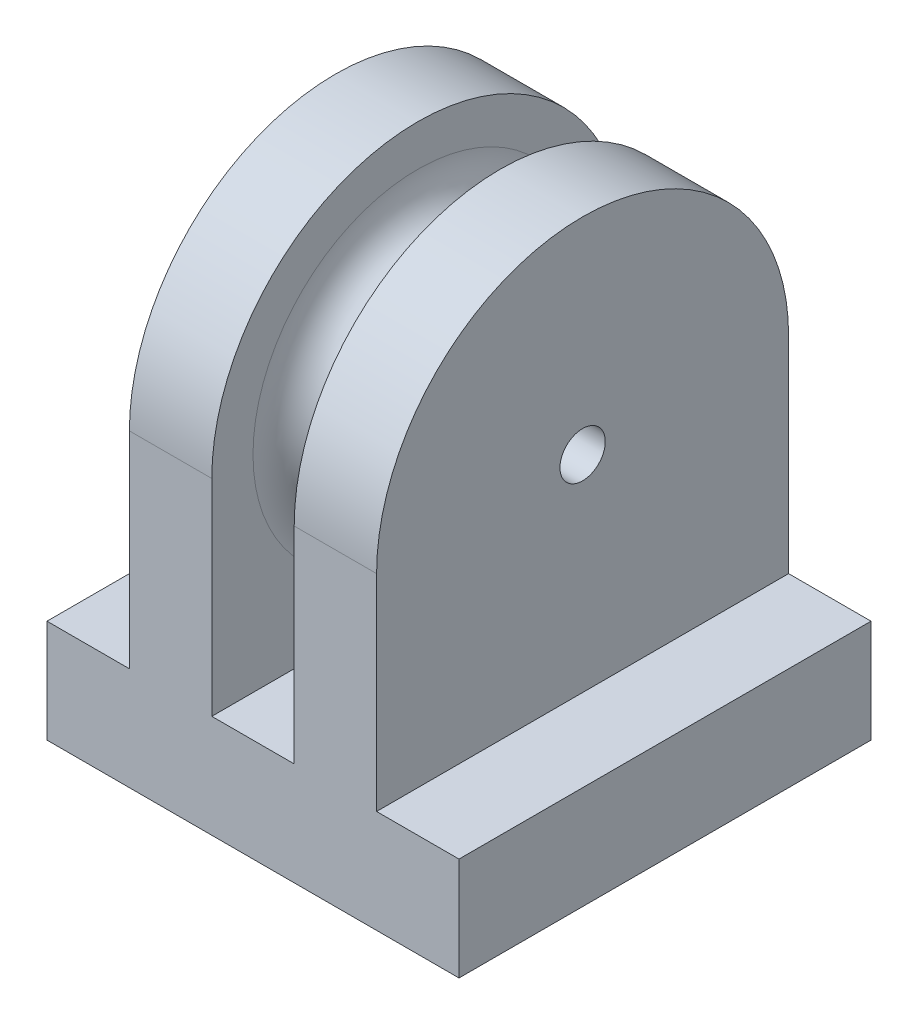
ISO-10303-21;
HEADER;
FILE_DESCRIPTION(('STEP AP214'),'2;1');
FILE_NAME('part.step','',(''),(''),'','','');
FILE_SCHEMA(('AUTOMOTIVE_DESIGN { 1 0 10303 214 1 1 1 1 }'));
ENDSEC;
DATA;
#1=APPLICATION_CONTEXT('core data for automotive mechanical design processes');
#2=APPLICATION_PROTOCOL_DEFINITION('international standard','automotive_design',2000,#1);
#3=PRODUCT_CONTEXT('',#1,'mechanical');
#4=PRODUCT('Part','Part','',(#3));
#5=PRODUCT_RELATED_PRODUCT_CATEGORY('part','',(#4));
#6=PRODUCT_DEFINITION_FORMATION('','',#4);
#7=PRODUCT_DEFINITION_CONTEXT('part definition',#1,'design');
#8=PRODUCT_DEFINITION('design','',#6,#7);
#9=PRODUCT_DEFINITION_SHAPE('','',#8);
#10=(LENGTH_UNIT() NAMED_UNIT(*) SI_UNIT(.MILLI.,.METRE.));
#11=(NAMED_UNIT(*) PLANE_ANGLE_UNIT() SI_UNIT($,.RADIAN.));
#12=(NAMED_UNIT(*) SI_UNIT($,.STERADIAN.) SOLID_ANGLE_UNIT());
#13=UNCERTAINTY_MEASURE_WITH_UNIT(LENGTH_MEASURE(1.E-05),#10,'distance_accuracy_value','');
#14=(GEOMETRIC_REPRESENTATION_CONTEXT(3) GLOBAL_UNCERTAINTY_ASSIGNED_CONTEXT((#13)) GLOBAL_UNIT_ASSIGNED_CONTEXT((#10,
#11,#12)) REPRESENTATION_CONTEXT('',''));
#15=CARTESIAN_POINT('',(0.,0.,0.));
#16=DIRECTION('',(0.,0.,1.));
#17=DIRECTION('',(1.,0.,0.));
#18=AXIS2_PLACEMENT_3D('',#15,#16,#17);
#19=CARTESIAN_POINT('',(0.,5.,0.));
#20=DIRECTION('',(0.,-1.,0.));
#21=DIRECTION('',(0.,0.,-1.));
#22=AXIS2_PLACEMENT_3D('',#19,#20,#21);
#23=PLANE('',#22);
#24=CARTESIAN_POINT('',(10.,5.,-4.));
#25=DIRECTION('',(0.,1.,0.));
#26=DIRECTION('',(0.,0.,1.));
#27=AXIS2_PLACEMENT_3D('',#24,#25,#26);
#28=CIRCLE('',#27,0.500000000000001);
#29=CARTESIAN_POINT('',(10.,5.,-3.5));
#30=VERTEX_POINT('',#29);
#31=EDGE_CURVE('E291',#30,#30,#28,.T.);
#32=ORIENTED_EDGE('',*,*,#31,.F.);
#33=EDGE_LOOP('',(#32));
#34=FACE_BOUND('',#33,.T.);
#35=CARTESIAN_POINT('',(10.,5.,-16.));
#36=DIRECTION('',(0.,1.,0.));
#37=DIRECTION('',(0.,0.,-1.));
#38=AXIS2_PLACEMENT_3D('',#35,#36,#37);
#39=CIRCLE('',#38,0.500000000000001);
#40=CARTESIAN_POINT('',(10.,5.,-16.5));
#41=VERTEX_POINT('',#40);
#42=EDGE_CURVE('E282',#41,#41,#39,.T.);
#43=ORIENTED_EDGE('',*,*,#42,.F.);
#44=EDGE_LOOP('',(#43));
#45=FACE_BOUND('',#44,.T.);
#46=DIRECTION('',(0.,0.,1.));
#47=VECTOR('',#46,1.);
#48=CARTESIAN_POINT('',(12.,5.,-20.));
#49=LINE('',#48,#47);
#50=CARTESIAN_POINT('',(12.,5.,-20.));
#51=VERTEX_POINT('',#50);
#52=CARTESIAN_POINT('',(12.,5.,0.));
#53=VERTEX_POINT('',#52);
#54=EDGE_CURVE('E66',#51,#53,#49,.T.);
#55=ORIENTED_EDGE('',*,*,#54,.F.);
#56=DIRECTION('',(-1.,0.,0.));
#57=VECTOR('',#56,1.);
#58=CARTESIAN_POINT('',(0.,5.,-20.));
#59=LINE('',#58,#57);
#60=CARTESIAN_POINT('',(8.,5.,-20.));
#61=VERTEX_POINT('',#60);
#62=EDGE_CURVE('E241',#51,#61,#59,.T.);
#63=ORIENTED_EDGE('',*,*,#62,.T.);
#64=DIRECTION('',(0.,0.,-1.));
#65=VECTOR('',#64,1.);
#66=CARTESIAN_POINT('',(8.,5.,-20.));
#67=LINE('',#66,#65);
#68=CARTESIAN_POINT('',(8.,5.,0.));
#69=VERTEX_POINT('',#68);
#70=EDGE_CURVE('E197',#69,#61,#67,.T.);
#71=ORIENTED_EDGE('',*,*,#70,.F.);
#72=DIRECTION('',(1.,0.,0.));
#73=VECTOR('',#72,1.);
#74=CARTESIAN_POINT('',(0.,5.,0.));
#75=LINE('',#74,#73);
#76=EDGE_CURVE('E233',#69,#53,#75,.T.);
#77=ORIENTED_EDGE('',*,*,#76,.T.);
#78=EDGE_LOOP('',(#55,#63,#71,#77));
#79=FACE_BOUND('',#78,.T.);
#80=ADVANCED_FACE('F41',(#34,#45,#79),#23,.F.);
#81=DIRECTION('',(0.,0.,-1.));
#82=VECTOR('',#81,1.);
#83=CARTESIAN_POINT('',(16.,5.,-20.));
#84=LINE('',#83,#82);
#85=CARTESIAN_POINT('',(16.,5.,0.));
#86=VERTEX_POINT('',#85);
#87=CARTESIAN_POINT('',(16.,5.,-20.));
#88=VERTEX_POINT('',#87);
#89=EDGE_CURVE('E58',#86,#88,#84,.T.);
#90=ORIENTED_EDGE('',*,*,#89,.F.);
#91=CARTESIAN_POINT('',(20.,5.,0.));
#92=VERTEX_POINT('',#91);
#93=EDGE_CURVE('E226',#86,#92,#75,.T.);
#94=ORIENTED_EDGE('',*,*,#93,.T.);
#95=DIRECTION('',(0.,0.,-1.));
#96=VECTOR('',#95,1.);
#97=CARTESIAN_POINT('',(20.,5.,0.));
#98=LINE('',#97,#96);
#99=CARTESIAN_POINT('',(20.,5.,-20.));
#100=VERTEX_POINT('',#99);
#101=EDGE_CURVE('E232',#92,#100,#98,.T.);
#102=ORIENTED_EDGE('',*,*,#101,.T.);
#103=EDGE_CURVE('E237',#100,#88,#59,.T.);
#104=ORIENTED_EDGE('',*,*,#103,.T.);
#105=EDGE_LOOP('',(#90,#94,#102,#104));
#106=FACE_BOUND('',#105,.T.);
#107=ADVANCED_FACE('F312',(#106),#23,.F.);
#108=DIRECTION('',(0.,0.,1.));
#109=VECTOR('',#108,1.);
#110=CARTESIAN_POINT('',(4.,5.,-20.));
#111=LINE('',#110,#109);
#112=CARTESIAN_POINT('',(4.,5.,-20.));
#113=VERTEX_POINT('',#112);
#114=CARTESIAN_POINT('',(4.,5.,0.));
#115=VERTEX_POINT('',#114);
#116=EDGE_CURVE('E191',#113,#115,#111,.T.);
#117=ORIENTED_EDGE('',*,*,#116,.F.);
#118=CARTESIAN_POINT('',(0.,5.,-20.));
#119=VERTEX_POINT('',#118);
#120=EDGE_CURVE('E236',#113,#119,#59,.T.);
#121=ORIENTED_EDGE('',*,*,#120,.T.);
#122=DIRECTION('',(0.,0.,1.));
#123=VECTOR('',#122,1.);
#124=CARTESIAN_POINT('',(0.,5.,0.));
#125=LINE('',#124,#123);
#126=CARTESIAN_POINT('',(0.,5.,0.));
#127=VERTEX_POINT('',#126);
#128=EDGE_CURVE('E222',#119,#127,#125,.T.);
#129=ORIENTED_EDGE('',*,*,#128,.T.);
#130=EDGE_CURVE('E228',#127,#115,#75,.T.);
#131=ORIENTED_EDGE('',*,*,#130,.T.);
#132=EDGE_LOOP('',(#117,#121,#129,#131));
#133=FACE_BOUND('',#132,.T.);
#134=ADVANCED_FACE('F314',(#133),#23,.F.);
#135=CARTESIAN_POINT('',(0.,5.,0.));
#136=DIRECTION('',(1.,0.,0.));
#137=DIRECTION('',(0.,0.,-1.));
#138=AXIS2_PLACEMENT_3D('',#135,#136,#137);
#139=PLANE('',#138);
#140=DIRECTION('',(0.,0.,1.));
#141=VECTOR('',#140,1.);
#142=CARTESIAN_POINT('',(0.,0.,0.));
#143=LINE('',#142,#141);
#144=CARTESIAN_POINT('',(0.,0.,-20.));
#145=VERTEX_POINT('',#144);
#146=CARTESIAN_POINT('',(0.,0.,0.));
#147=VERTEX_POINT('',#146);
#148=EDGE_CURVE('E221',#145,#147,#143,.T.);
#149=ORIENTED_EDGE('',*,*,#148,.T.);
#150=DIRECTION('',(0.,-1.,0.));
#151=VECTOR('',#150,1.);
#152=CARTESIAN_POINT('',(0.,5.,0.));
#153=LINE('',#152,#151);
#154=EDGE_CURVE('E264',#127,#147,#153,.T.);
#155=ORIENTED_EDGE('',*,*,#154,.F.);
#156=ORIENTED_EDGE('',*,*,#128,.F.);
#157=DIRECTION('',(0.,-1.,0.));
#158=VECTOR('',#157,1.);
#159=CARTESIAN_POINT('',(0.,5.,-20.));
#160=LINE('',#159,#158);
#161=EDGE_CURVE('E240',#119,#145,#160,.T.);
#162=ORIENTED_EDGE('',*,*,#161,.T.);
#163=EDGE_LOOP('',(#149,#155,#156,#162));
#164=FACE_BOUND('',#163,.T.);
#165=ADVANCED_FACE('F335',(#164),#139,.F.);
#166=CARTESIAN_POINT('',(0.,5.,0.));
#167=DIRECTION('',(0.,0.,-1.));
#168=DIRECTION('',(-1.,0.,0.));
#169=AXIS2_PLACEMENT_3D('',#166,#167,#168);
#170=PLANE('',#169);
#171=DIRECTION('',(1.,0.,0.));
#172=VECTOR('',#171,1.);
#173=CARTESIAN_POINT('',(0.,0.,0.));
#174=LINE('',#173,#172);
#175=CARTESIAN_POINT('',(20.,0.,0.));
#176=VERTEX_POINT('',#175);
#177=EDGE_CURVE('E245',#147,#176,#174,.T.);
#178=ORIENTED_EDGE('',*,*,#177,.T.);
#179=DIRECTION('',(0.,-1.,0.));
#180=VECTOR('',#179,1.);
#181=CARTESIAN_POINT('',(20.,5.,0.));
#182=LINE('',#181,#180);
#183=EDGE_CURVE('E260',#92,#176,#182,.T.);
#184=ORIENTED_EDGE('',*,*,#183,.F.);
#185=ORIENTED_EDGE('',*,*,#93,.F.);
#186=DIRECTION('',(0.,-1.,0.));
#187=VECTOR('',#186,1.);
#188=CARTESIAN_POINT('',(16.,15.,0.));
#189=LINE('',#188,#187);
#190=CARTESIAN_POINT('',(16.,15.,0.));
#191=VERTEX_POINT('',#190);
#192=EDGE_CURVE('E153',#191,#86,#189,.T.);
#193=ORIENTED_EDGE('',*,*,#192,.F.);
#194=DIRECTION('',(1.,0.,0.));
#195=VECTOR('',#194,1.);
#196=CARTESIAN_POINT('',(12.,15.,0.));
#197=LINE('',#196,#195);
#198=CARTESIAN_POINT('',(12.,15.,0.));
#199=VERTEX_POINT('',#198);
#200=EDGE_CURVE('E145',#199,#191,#197,.T.);
#201=ORIENTED_EDGE('',*,*,#200,.F.);
#202=DIRECTION('',(0.,-1.,0.));
#203=VECTOR('',#202,1.);
#204=CARTESIAN_POINT('',(12.,15.,0.));
#205=LINE('',#204,#203);
#206=EDGE_CURVE('E187',#199,#53,#205,.T.);
#207=ORIENTED_EDGE('',*,*,#206,.T.);
#208=ORIENTED_EDGE('',*,*,#76,.F.);
#209=DIRECTION('',(0.,-1.,0.));
#210=VECTOR('',#209,1.);
#211=CARTESIAN_POINT('',(8.,15.,0.));
#212=LINE('',#211,#210);
#213=CARTESIAN_POINT('',(8.,15.,0.));
#214=VERTEX_POINT('',#213);
#215=EDGE_CURVE('E213',#214,#69,#212,.T.);
#216=ORIENTED_EDGE('',*,*,#215,.F.);
#217=DIRECTION('',(1.,0.,0.));
#218=VECTOR('',#217,1.);
#219=CARTESIAN_POINT('',(4.,15.,0.));
#220=LINE('',#219,#218);
#221=CARTESIAN_POINT('',(4.,15.,0.));
#222=VERTEX_POINT('',#221);
#223=EDGE_CURVE('E192',#222,#214,#220,.T.);
#224=ORIENTED_EDGE('',*,*,#223,.F.);
#225=DIRECTION('',(0.,-1.,0.));
#226=VECTOR('',#225,1.);
#227=CARTESIAN_POINT('',(4.,15.,0.));
#228=LINE('',#227,#226);
#229=EDGE_CURVE('E217',#222,#115,#228,.T.);
#230=ORIENTED_EDGE('',*,*,#229,.T.);
#231=ORIENTED_EDGE('',*,*,#130,.F.);
#232=ORIENTED_EDGE('',*,*,#154,.T.);
#233=EDGE_LOOP('',(#178,#184,#185,#193,#201,#207,#208,#216,#224,#230,#231,#232));
#234=FACE_BOUND('',#233,.T.);
#235=ADVANCED_FACE('F320',(#234),#170,.F.);
#236=CARTESIAN_POINT('',(20.,5.,0.));
#237=DIRECTION('',(-1.,0.,0.));
#238=DIRECTION('',(0.,0.,1.));
#239=AXIS2_PLACEMENT_3D('',#236,#237,#238);
#240=PLANE('',#239);
#241=DIRECTION('',(0.,0.,-1.));
#242=VECTOR('',#241,1.);
#243=CARTESIAN_POINT('',(20.,0.,0.));
#244=LINE('',#243,#242);
#245=CARTESIAN_POINT('',(20.,0.,-20.));
#246=VERTEX_POINT('',#245);
#247=EDGE_CURVE('E248',#176,#246,#244,.T.);
#248=ORIENTED_EDGE('',*,*,#247,.T.);
#249=DIRECTION('',(0.,-1.,0.));
#250=VECTOR('',#249,1.);
#251=CARTESIAN_POINT('',(20.,5.,-20.));
#252=LINE('',#251,#250);
#253=EDGE_CURVE('E256',#100,#246,#252,.T.);
#254=ORIENTED_EDGE('',*,*,#253,.F.);
#255=ORIENTED_EDGE('',*,*,#101,.F.);
#256=ORIENTED_EDGE('',*,*,#183,.T.);
#257=EDGE_LOOP('',(#248,#254,#255,#256));
#258=FACE_BOUND('',#257,.T.);
#259=ADVANCED_FACE('F363',(#258),#240,.F.);
#260=CARTESIAN_POINT('',(0.,5.,-20.));
#261=DIRECTION('',(0.,0.,1.));
#262=DIRECTION('',(1.,0.,0.));
#263=AXIS2_PLACEMENT_3D('',#260,#261,#262);
#264=PLANE('',#263);
#265=DIRECTION('',(-1.,0.,0.));
#266=VECTOR('',#265,1.);
#267=CARTESIAN_POINT('',(0.,0.,-20.));
#268=LINE('',#267,#266);
#269=EDGE_CURVE('E227',#246,#145,#268,.T.);
#270=ORIENTED_EDGE('',*,*,#269,.T.);
#271=ORIENTED_EDGE('',*,*,#161,.F.);
#272=ORIENTED_EDGE('',*,*,#120,.F.);
#273=DIRECTION('',(0.,-1.,0.));
#274=VECTOR('',#273,1.);
#275=CARTESIAN_POINT('',(4.,15.,-20.));
#276=LINE('',#275,#274);
#277=CARTESIAN_POINT('',(4.,15.,-20.));
#278=VERTEX_POINT('',#277);
#279=EDGE_CURVE('E201',#278,#113,#276,.T.);
#280=ORIENTED_EDGE('',*,*,#279,.F.);
#281=DIRECTION('',(-1.,0.,0.));
#282=VECTOR('',#281,1.);
#283=CARTESIAN_POINT('',(4.,15.,-20.));
#284=LINE('',#283,#282);
#285=CARTESIAN_POINT('',(8.,15.,-20.));
#286=VERTEX_POINT('',#285);
#287=EDGE_CURVE('E196',#286,#278,#284,.T.);
#288=ORIENTED_EDGE('',*,*,#287,.F.);
#289=DIRECTION('',(0.,-1.,0.));
#290=VECTOR('',#289,1.);
#291=CARTESIAN_POINT('',(8.,15.,-20.));
#292=LINE('',#291,#290);
#293=EDGE_CURVE('E209',#286,#61,#292,.T.);
#294=ORIENTED_EDGE('',*,*,#293,.T.);
#295=ORIENTED_EDGE('',*,*,#62,.F.);
#296=DIRECTION('',(0.,-1.,0.));
#297=VECTOR('',#296,1.);
#298=CARTESIAN_POINT('',(12.,15.,-20.));
#299=LINE('',#298,#297);
#300=CARTESIAN_POINT('',(12.,15.,-20.));
#301=VERTEX_POINT('',#300);
#302=EDGE_CURVE('E139',#301,#51,#299,.T.);
#303=ORIENTED_EDGE('',*,*,#302,.F.);
#304=DIRECTION('',(-1.,0.,0.));
#305=VECTOR('',#304,1.);
#306=CARTESIAN_POINT('',(12.,15.,-20.));
#307=LINE('',#306,#305);
#308=CARTESIAN_POINT('',(16.,15.,-20.));
#309=VERTEX_POINT('',#308);
#310=EDGE_CURVE('E134',#309,#301,#307,.T.);
#311=ORIENTED_EDGE('',*,*,#310,.F.);
#312=DIRECTION('',(0.,-1.,0.));
#313=VECTOR('',#312,1.);
#314=CARTESIAN_POINT('',(16.,15.,-20.));
#315=LINE('',#314,#313);
#316=EDGE_CURVE('E138',#309,#88,#315,.T.);
#317=ORIENTED_EDGE('',*,*,#316,.T.);
#318=ORIENTED_EDGE('',*,*,#103,.F.);
#319=ORIENTED_EDGE('',*,*,#253,.T.);
#320=EDGE_LOOP('',(#270,#271,#272,#280,#288,#294,#295,#303,#311,#317,#318,#319));
#321=FACE_BOUND('',#320,.T.);
#322=ADVANCED_FACE('F136',(#321),#264,.F.);
#323=CARTESIAN_POINT('',(0.,0.,0.));
#324=DIRECTION('',(0.,-1.,0.));
#325=DIRECTION('',(0.,0.,-1.));
#326=AXIS2_PLACEMENT_3D('',#323,#324,#325);
#327=PLANE('',#326);
#328=CARTESIAN_POINT('',(10.,0.,-4.));
#329=DIRECTION('',(0.,1.,0.));
#330=DIRECTION('',(0.,0.,1.));
#331=AXIS2_PLACEMENT_3D('',#328,#329,#330);
#332=CIRCLE('',#331,0.500000000000001);
#333=CARTESIAN_POINT('',(10.,0.,-3.5));
#334=VERTEX_POINT('',#333);
#335=EDGE_CURVE('E296',#334,#334,#332,.T.);
#336=ORIENTED_EDGE('',*,*,#335,.T.);
#337=EDGE_LOOP('',(#336));
#338=FACE_BOUND('',#337,.T.);
#339=CARTESIAN_POINT('',(10.,0.,-16.));
#340=DIRECTION('',(0.,1.,0.));
#341=DIRECTION('',(0.,0.,-1.));
#342=AXIS2_PLACEMENT_3D('',#339,#340,#341);
#343=CIRCLE('',#342,0.500000000000001);
#344=CARTESIAN_POINT('',(10.,0.,-16.5));
#345=VERTEX_POINT('',#344);
#346=EDGE_CURVE('E285',#345,#345,#343,.T.);
#347=ORIENTED_EDGE('',*,*,#346,.T.);
#348=EDGE_LOOP('',(#347));
#349=FACE_BOUND('',#348,.T.);
#350=ORIENTED_EDGE('',*,*,#148,.F.);
#351=ORIENTED_EDGE('',*,*,#269,.F.);
#352=ORIENTED_EDGE('',*,*,#247,.F.);
#353=ORIENTED_EDGE('',*,*,#177,.F.);
#354=EDGE_LOOP('',(#350,#351,#352,#353));
#355=FACE_BOUND('',#354,.T.);
#356=ADVANCED_FACE('F353',(#338,#349,#355),#327,.T.);
#357=CARTESIAN_POINT('',(4.,15.,-20.));
#358=DIRECTION('',(1.,0.,0.));
#359=DIRECTION('',(0.,0.,-1.));
#360=AXIS2_PLACEMENT_3D('',#357,#358,#359);
#361=PLANE('',#360);
#362=CARTESIAN_POINT('',(4.,15.,-10.));
#363=DIRECTION('',(-1.,0.,0.));
#364=DIRECTION('',(0.,0.,1.));
#365=AXIS2_PLACEMENT_3D('',#362,#363,#364);
#366=CIRCLE('',#365,1.1);
#367=CARTESIAN_POINT('',(4.,15.,-8.9));
#368=VERTEX_POINT('',#367);
#369=EDGE_CURVE('E166',#368,#368,#366,.T.);
#370=ORIENTED_EDGE('',*,*,#369,.F.);
#371=EDGE_LOOP('',(#370));
#372=FACE_BOUND('',#371,.T.);
#373=ORIENTED_EDGE('',*,*,#116,.T.);
#374=ORIENTED_EDGE('',*,*,#229,.F.);
#375=CARTESIAN_POINT('',(4.,15.,-10.));
#376=DIRECTION('',(-1.,0.,0.));
#377=DIRECTION('',(0.,0.,1.));
#378=AXIS2_PLACEMENT_3D('',#375,#376,#377);
#379=CIRCLE('',#378,10.);
#380=EDGE_CURVE('E163',#222,#278,#379,.T.);
#381=ORIENTED_EDGE('',*,*,#380,.T.);
#382=ORIENTED_EDGE('',*,*,#279,.T.);
#383=EDGE_LOOP('',(#373,#374,#381,#382));
#384=FACE_BOUND('',#383,.T.);
#385=ADVANCED_FACE('F339',(#372,#384),#361,.F.);
#386=CARTESIAN_POINT('',(8.,15.,-20.));
#387=DIRECTION('',(-1.,0.,0.));
#388=DIRECTION('',(0.,0.,1.));
#389=AXIS2_PLACEMENT_3D('',#386,#387,#388);
#390=PLANE('',#389);
#391=CARTESIAN_POINT('',(8.,15.,-10.));
#392=DIRECTION('',(-1.,0.,0.));
#393=DIRECTION('',(0.,0.,1.));
#394=AXIS2_PLACEMENT_3D('',#391,#392,#393);
#395=CIRCLE('',#394,8.);
#396=CARTESIAN_POINT('',(8.,15.,-2.));
#397=VERTEX_POINT('',#396);
#398=EDGE_CURVE('E51',#397,#397,#395,.T.);
#399=ORIENTED_EDGE('',*,*,#398,.T.);
#400=EDGE_LOOP('',(#399));
#401=FACE_BOUND('',#400,.T.);
#402=ORIENTED_EDGE('',*,*,#70,.T.);
#403=ORIENTED_EDGE('',*,*,#293,.F.);
#404=CARTESIAN_POINT('',(8.,15.,-10.));
#405=DIRECTION('',(-1.,0.,0.));
#406=DIRECTION('',(0.,0.,1.));
#407=AXIS2_PLACEMENT_3D('',#404,#405,#406);
#408=CIRCLE('',#407,10.);
#409=EDGE_CURVE('E170',#214,#286,#408,.T.);
#410=ORIENTED_EDGE('',*,*,#409,.F.);
#411=ORIENTED_EDGE('',*,*,#215,.T.);
#412=EDGE_LOOP('',(#402,#403,#410,#411));
#413=FACE_BOUND('',#412,.T.);
#414=ADVANCED_FACE('F272',(#401,#413),#390,.F.);
#415=CARTESIAN_POINT('',(12.,15.,-20.));
#416=DIRECTION('',(1.,0.,0.));
#417=DIRECTION('',(0.,0.,-1.));
#418=AXIS2_PLACEMENT_3D('',#415,#416,#417);
#419=PLANE('',#418);
#420=CARTESIAN_POINT('',(12.,15.,-10.));
#421=DIRECTION('',(1.,0.,0.));
#422=DIRECTION('',(0.,0.,-1.));
#423=AXIS2_PLACEMENT_3D('',#420,#421,#422);
#424=CIRCLE('',#423,8.);
#425=CARTESIAN_POINT('',(12.,15.,-18.));
#426=VERTEX_POINT('',#425);
#427=EDGE_CURVE('E11',#426,#426,#424,.T.);
#428=ORIENTED_EDGE('',*,*,#427,.T.);
#429=EDGE_LOOP('',(#428));
#430=FACE_BOUND('',#429,.T.);
#431=ORIENTED_EDGE('',*,*,#54,.T.);
#432=ORIENTED_EDGE('',*,*,#206,.F.);
#433=CARTESIAN_POINT('',(12.,15.,-10.));
#434=DIRECTION('',(1.,0.,0.));
#435=DIRECTION('',(0.,0.,-1.));
#436=AXIS2_PLACEMENT_3D('',#433,#434,#435);
#437=CIRCLE('',#436,10.);
#438=EDGE_CURVE('E158',#301,#199,#437,.T.);
#439=ORIENTED_EDGE('',*,*,#438,.F.);
#440=ORIENTED_EDGE('',*,*,#302,.T.);
#441=EDGE_LOOP('',(#431,#432,#439,#440));
#442=FACE_BOUND('',#441,.T.);
#443=ADVANCED_FACE('F318',(#430,#442),#419,.F.);
#444=CARTESIAN_POINT('',(16.,15.,-20.));
#445=DIRECTION('',(-1.,0.,0.));
#446=DIRECTION('',(0.,0.,1.));
#447=AXIS2_PLACEMENT_3D('',#444,#445,#446);
#448=PLANE('',#447);
#449=CARTESIAN_POINT('',(16.,15.,-10.));
#450=DIRECTION('',(-1.,0.,0.));
#451=DIRECTION('',(0.,0.,1.));
#452=AXIS2_PLACEMENT_3D('',#449,#450,#451);
#453=CIRCLE('',#452,1.1);
#454=CARTESIAN_POINT('',(16.,15.,-8.9));
#455=VERTEX_POINT('',#454);
#456=EDGE_CURVE('E159',#455,#455,#453,.T.);
#457=ORIENTED_EDGE('',*,*,#456,.T.);
#458=EDGE_LOOP('',(#457));
#459=FACE_BOUND('',#458,.T.);
#460=ORIENTED_EDGE('',*,*,#89,.T.);
#461=ORIENTED_EDGE('',*,*,#316,.F.);
#462=CARTESIAN_POINT('',(16.,15.,-10.));
#463=DIRECTION('',(1.,0.,0.));
#464=DIRECTION('',(0.,0.,-1.));
#465=AXIS2_PLACEMENT_3D('',#462,#463,#464);
#466=CIRCLE('',#465,10.);
#467=EDGE_CURVE('E151',#309,#191,#466,.T.);
#468=ORIENTED_EDGE('',*,*,#467,.T.);
#469=ORIENTED_EDGE('',*,*,#192,.T.);
#470=EDGE_LOOP('',(#460,#461,#468,#469));
#471=FACE_BOUND('',#470,.T.);
#472=ADVANCED_FACE('F149',(#459,#471),#448,.F.);
#473=CARTESIAN_POINT('',(8.,15.,-10.));
#474=DIRECTION('',(-1.,0.,0.));
#475=DIRECTION('',(0.,0.,1.));
#476=AXIS2_PLACEMENT_3D('',#473,#474,#475);
#477=CYLINDRICAL_SURFACE('',#476,10.);
#478=ORIENTED_EDGE('',*,*,#409,.T.);
#479=ORIENTED_EDGE('',*,*,#287,.T.);
#480=ORIENTED_EDGE('',*,*,#380,.F.);
#481=ORIENTED_EDGE('',*,*,#223,.T.);
#482=EDGE_LOOP('',(#478,#479,#480,#481));
#483=FACE_BOUND('',#482,.T.);
#484=ADVANCED_FACE('F342',(#483),#477,.T.);
#485=CARTESIAN_POINT('',(12.,15.,-10.));
#486=DIRECTION('',(1.,0.,0.));
#487=DIRECTION('',(0.,0.,-1.));
#488=AXIS2_PLACEMENT_3D('',#485,#486,#487);
#489=CYLINDRICAL_SURFACE('',#488,10.);
#490=ORIENTED_EDGE('',*,*,#438,.T.);
#491=ORIENTED_EDGE('',*,*,#200,.T.);
#492=ORIENTED_EDGE('',*,*,#467,.F.);
#493=ORIENTED_EDGE('',*,*,#310,.T.);
#494=EDGE_LOOP('',(#490,#491,#492,#493));
#495=FACE_BOUND('',#494,.T.);
#496=ADVANCED_FACE('F156',(#495),#489,.T.);
#497=CARTESIAN_POINT('',(20.,15.,-10.));
#498=DIRECTION('',(-1.,0.,0.));
#499=DIRECTION('',(0.,0.,1.));
#500=AXIS2_PLACEMENT_3D('',#497,#498,#499);
#501=CYLINDRICAL_SURFACE('',#500,1.1);
#502=ORIENTED_EDGE('',*,*,#369,.T.);
#503=EDGE_LOOP('',(#502));
#504=FACE_BOUND('',#503,.T.);
#505=ORIENTED_EDGE('',*,*,#456,.F.);
#506=EDGE_LOOP('',(#505));
#507=FACE_BOUND('',#506,.T.);
#508=ADVANCED_FACE('F439',(#504,#507),#501,.F.);
#509=CARTESIAN_POINT('',(10.,0.,-16.));
#510=DIRECTION('',(0.,1.,0.));
#511=DIRECTION('',(0.,0.,1.));
#512=AXIS2_PLACEMENT_3D('',#509,#510,#511);
#513=CYLINDRICAL_SURFACE('',#512,0.500000000000001);
#514=ORIENTED_EDGE('',*,*,#346,.F.);
#515=EDGE_LOOP('',(#514));
#516=FACE_BOUND('',#515,.T.);
#517=ORIENTED_EDGE('',*,*,#42,.T.);
#518=EDGE_LOOP('',(#517));
#519=FACE_BOUND('',#518,.T.);
#520=ADVANCED_FACE('F444',(#516,#519),#513,.F.);
#521=CARTESIAN_POINT('',(10.,0.,-4.));
#522=DIRECTION('',(0.,1.,0.));
#523=DIRECTION('',(0.,0.,1.));
#524=AXIS2_PLACEMENT_3D('',#521,#522,#523);
#525=CYLINDRICAL_SURFACE('',#524,0.500000000000001);
#526=ORIENTED_EDGE('',*,*,#335,.F.);
#527=EDGE_LOOP('',(#526));
#528=FACE_BOUND('',#527,.T.);
#529=ORIENTED_EDGE('',*,*,#31,.T.);
#530=EDGE_LOOP('',(#529));
#531=FACE_BOUND('',#530,.T.);
#532=ADVANCED_FACE('F308',(#528,#531),#525,.F.);
#533=CARTESIAN_POINT('',(10.,15.,-10.));
#534=DIRECTION('',(1.,0.,0.));
#535=DIRECTION('',(0.,0.,-1.));
#536=AXIS2_PLACEMENT_3D('',#533,#534,#535);
#537=TOROIDAL_SURFACE('',#536,8.,2.);
#538=ORIENTED_EDGE('',*,*,#427,.F.);
#539=EDGE_LOOP('',(#538));
#540=FACE_BOUND('',#539,.T.);
#541=CARTESIAN_POINT('',(10.,15.,-10.));
#542=DIRECTION('',(1.,0.,0.));
#543=DIRECTION('',(0.,0.,-1.));
#544=AXIS2_PLACEMENT_3D('',#541,#542,#543);
#545=CIRCLE('',#544,6.);
#546=CARTESIAN_POINT('',(10.,15.,-16.));
#547=VERTEX_POINT('',#546);
#548=EDGE_CURVE('E45',#547,#547,#545,.F.);
#549=ORIENTED_EDGE('',*,*,#548,.F.);
#550=EDGE_LOOP('',(#549));
#551=FACE_BOUND('',#550,.T.);
#552=ADVANCED_FACE('F43',(#540,#551),#537,.F.);
#553=CARTESIAN_POINT('',(10.,15.,-10.));
#554=DIRECTION('',(-1.,0.,0.));
#555=DIRECTION('',(0.,0.,1.));
#556=AXIS2_PLACEMENT_3D('',#553,#554,#555);
#557=TOROIDAL_SURFACE('',#556,8.,2.);
#558=ORIENTED_EDGE('',*,*,#398,.F.);
#559=EDGE_LOOP('',(#558));
#560=FACE_BOUND('',#559,.T.);
#561=ORIENTED_EDGE('',*,*,#548,.T.);
#562=EDGE_LOOP('',(#561));
#563=FACE_BOUND('',#562,.T.);
#564=ADVANCED_FACE('F275',(#560,#563),#557,.F.);
#565=CLOSED_SHELL('',(#80,#107,#134,#165,#235,#259,#322,#356,#385,#414,#443,#472,#484,#496,#508,
#520,#532,#552,#564));
#566=MANIFOLD_SOLID_BREP('B2',#565);
#567=ADVANCED_BREP_SHAPE_REPRESENTATION('',(#18,#566),#14);
#568=SHAPE_DEFINITION_REPRESENTATION(#9,#567);
ENDSEC;
END-ISO-10303-21;
